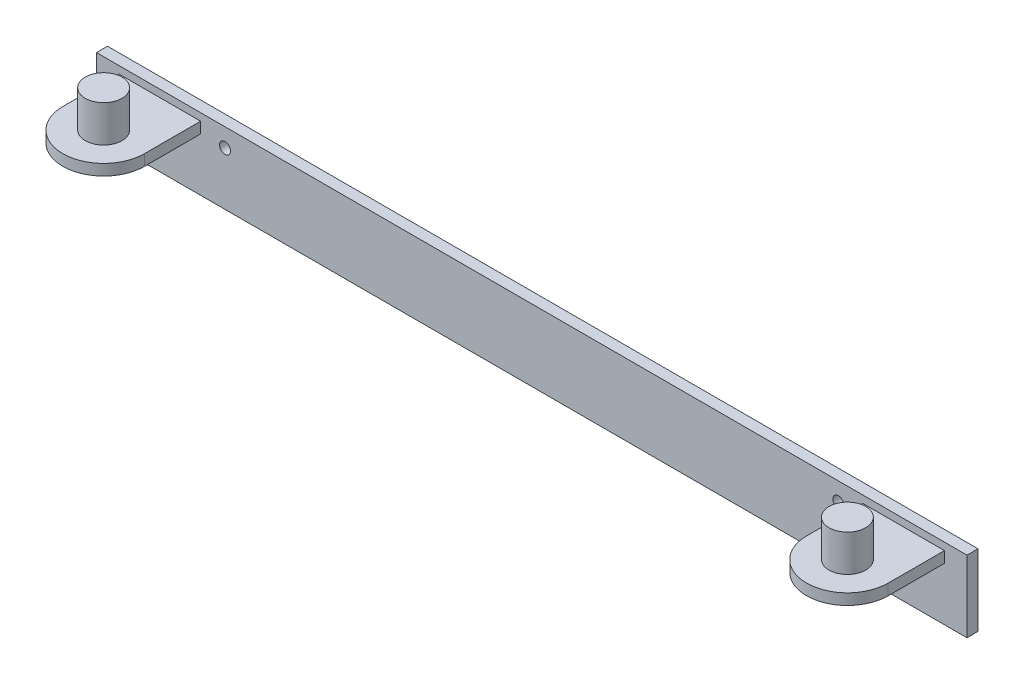
ISO-10303-21;
HEADER;
FILE_DESCRIPTION(('STEP AP214'),'2;1');
FILE_NAME('part.step','',(''),(''),'','','');
FILE_SCHEMA(('AUTOMOTIVE_DESIGN { 1 0 10303 214 1 1 1 1 }'));
ENDSEC;
DATA;
#1=APPLICATION_CONTEXT('core data for automotive mechanical design processes');
#2=APPLICATION_PROTOCOL_DEFINITION('international standard','automotive_design',2000,#1);
#3=PRODUCT_CONTEXT('',#1,'mechanical');
#4=PRODUCT('Part','Part','',(#3));
#5=PRODUCT_RELATED_PRODUCT_CATEGORY('part','',(#4));
#6=PRODUCT_DEFINITION_FORMATION('','',#4);
#7=PRODUCT_DEFINITION_CONTEXT('part definition',#1,'design');
#8=PRODUCT_DEFINITION('design','',#6,#7);
#9=PRODUCT_DEFINITION_SHAPE('','',#8);
#10=(LENGTH_UNIT() NAMED_UNIT(*) SI_UNIT(.MILLI.,.METRE.));
#11=(NAMED_UNIT(*) PLANE_ANGLE_UNIT() SI_UNIT($,.RADIAN.));
#12=(NAMED_UNIT(*) SI_UNIT($,.STERADIAN.) SOLID_ANGLE_UNIT());
#13=UNCERTAINTY_MEASURE_WITH_UNIT(LENGTH_MEASURE(1.E-05),#10,'distance_accuracy_value','');
#14=(GEOMETRIC_REPRESENTATION_CONTEXT(3) GLOBAL_UNCERTAINTY_ASSIGNED_CONTEXT((#13)) GLOBAL_UNIT_ASSIGNED_CONTEXT((#10,
#11,#12)) REPRESENTATION_CONTEXT('',''));
#15=CARTESIAN_POINT('',(0.,0.,0.));
#16=DIRECTION('',(0.,0.,1.));
#17=DIRECTION('',(1.,0.,0.));
#18=AXIS2_PLACEMENT_3D('',#15,#16,#17);
#19=CARTESIAN_POINT('',(160.782989934974,10.8857174638487,18.3099999999999));
#20=DIRECTION('',(0.,-1.,0.));
#21=DIRECTION('',(0.,0.,-1.));
#22=AXIS2_PLACEMENT_3D('',#19,#20,#21);
#23=PLANE('',#22);
#24=DIRECTION('',(0.,0.,-1.));
#25=VECTOR('',#24,1.);
#26=CARTESIAN_POINT('',(171.897989934974,10.8857174638487,2.99999999999994));
#27=LINE('',#26,#25);
#28=CARTESIAN_POINT('',(171.897989934974,10.8857174638487,18.3099999999999));
#29=VERTEX_POINT('',#28);
#30=CARTESIAN_POINT('',(171.897989934974,10.8857174638487,3.));
#31=VERTEX_POINT('',#30);
#32=EDGE_CURVE('E48',#29,#31,#27,.T.);
#33=ORIENTED_EDGE('',*,*,#32,.T.);
#34=DIRECTION('',(-1.,0.,0.));
#35=VECTOR('',#34,1.);
#36=CARTESIAN_POINT('',(171.897989934974,10.8857174638487,2.99999999999994));
#37=LINE('',#36,#35);
#38=CARTESIAN_POINT('',(149.667989934974,10.8857174638487,2.99999999999996));
#39=VERTEX_POINT('',#38);
#40=EDGE_CURVE('E146',#31,#39,#37,.T.);
#41=ORIENTED_EDGE('',*,*,#40,.T.);
#42=DIRECTION('',(0.,0.,1.));
#43=VECTOR('',#42,1.);
#44=CARTESIAN_POINT('',(149.667989934974,10.8857174638487,2.99999999999996));
#45=LINE('',#44,#43);
#46=CARTESIAN_POINT('',(149.667989934974,10.8857174638487,18.31));
#47=VERTEX_POINT('',#46);
#48=EDGE_CURVE('E238',#39,#47,#45,.T.);
#49=ORIENTED_EDGE('',*,*,#48,.T.);
#50=CARTESIAN_POINT('',(160.782989934974,10.8857174638487,18.3099999999999));
#51=DIRECTION('',(0.,1.,0.));
#52=DIRECTION('',(0.,0.,-1.));
#53=AXIS2_PLACEMENT_3D('',#50,#51,#52);
#54=CIRCLE('',#53,11.115);
#55=EDGE_CURVE('E142',#47,#29,#54,.T.);
#56=ORIENTED_EDGE('',*,*,#55,.T.);
#57=EDGE_LOOP('',(#33,#41,#49,#56));
#58=FACE_BOUND('',#57,.T.);
#59=CARTESIAN_POINT('',(160.782989934974,10.8857174638487,18.3099999999999));
#60=DIRECTION('',(0.,-1.,0.));
#61=DIRECTION('',(0.,0.,-1.));
#62=AXIS2_PLACEMENT_3D('',#59,#60,#61);
#63=CIRCLE('',#62,4.99999999999999);
#64=CARTESIAN_POINT('',(160.782989934974,10.8857174638487,13.31));
#65=VERTEX_POINT('',#64);
#66=EDGE_CURVE('E11',#65,#65,#63,.F.);
#67=ORIENTED_EDGE('',*,*,#66,.F.);
#68=EDGE_LOOP('',(#67));
#69=FACE_BOUND('',#68,.T.);
#70=ADVANCED_FACE('F31',(#58,#69),#23,.F.);
#71=CARTESIAN_POINT('',(-41.7270100650257,10.8857174638487,18.31));
#72=DIRECTION('',(0.,1.,0.));
#73=DIRECTION('',(0.,0.,1.));
#74=AXIS2_PLACEMENT_3D('',#71,#72,#73);
#75=PLANE('',#74);
#76=DIRECTION('',(-1.,0.,0.));
#77=VECTOR('',#76,1.);
#78=CARTESIAN_POINT('',(-52.8420100650257,10.8857174638487,3.));
#79=LINE('',#78,#77);
#80=CARTESIAN_POINT('',(-30.6120100650257,10.8857174638487,3.));
#81=VERTEX_POINT('',#80);
#82=CARTESIAN_POINT('',(-52.8420100650257,10.8857174638487,3.));
#83=VERTEX_POINT('',#82);
#84=EDGE_CURVE('E168',#81,#83,#79,.T.);
#85=ORIENTED_EDGE('',*,*,#84,.T.);
#86=DIRECTION('',(0.,0.,1.));
#87=VECTOR('',#86,1.);
#88=CARTESIAN_POINT('',(-52.8420100650257,10.8857174638487,3.));
#89=LINE('',#88,#87);
#90=CARTESIAN_POINT('',(-52.8420100650257,10.8857174638487,18.31));
#91=VERTEX_POINT('',#90);
#92=EDGE_CURVE('E171',#83,#91,#89,.T.);
#93=ORIENTED_EDGE('',*,*,#92,.T.);
#94=CARTESIAN_POINT('',(-41.7270100650257,10.8857174638487,18.31));
#95=DIRECTION('',(0.,1.,0.));
#96=DIRECTION('',(0.,0.,1.));
#97=AXIS2_PLACEMENT_3D('',#94,#95,#96);
#98=CIRCLE('',#97,11.115);
#99=CARTESIAN_POINT('',(-30.6120100650257,10.8857174638487,18.31));
#100=VERTEX_POINT('',#99);
#101=EDGE_CURVE('E174',#91,#100,#98,.T.);
#102=ORIENTED_EDGE('',*,*,#101,.T.);
#103=DIRECTION('',(0.,0.,-1.));
#104=VECTOR('',#103,1.);
#105=CARTESIAN_POINT('',(-30.6120100650257,10.8857174638487,3.));
#106=LINE('',#105,#104);
#107=EDGE_CURVE('E158',#100,#81,#106,.T.);
#108=ORIENTED_EDGE('',*,*,#107,.T.);
#109=EDGE_LOOP('',(#85,#93,#102,#108));
#110=FACE_BOUND('',#109,.T.);
#111=CARTESIAN_POINT('',(-41.7270100650257,10.8857174638487,18.31));
#112=DIRECTION('',(0.,1.,0.));
#113=DIRECTION('',(0.,0.,1.));
#114=AXIS2_PLACEMENT_3D('',#111,#112,#113);
#115=CIRCLE('',#114,5.);
#116=CARTESIAN_POINT('',(-41.7270100650257,10.8857174638487,23.31));
#117=VERTEX_POINT('',#116);
#118=EDGE_CURVE('E220',#117,#117,#115,.T.);
#119=ORIENTED_EDGE('',*,*,#118,.F.);
#120=EDGE_LOOP('',(#119));
#121=FACE_BOUND('',#120,.T.);
#122=ADVANCED_FACE('F259',(#110,#121),#75,.T.);
#123=CARTESIAN_POINT('',(-58.9770100650257,-6.60428253615128,3.));
#124=DIRECTION('',(0.,0.,1.));
#125=DIRECTION('',(1.,0.,0.));
#126=AXIS2_PLACEMENT_3D('',#123,#124,#125);
#127=PLANE('',#126);
#128=CARTESIAN_POINT('',(143.032989934974,7.88571746384872,3.));
#129=DIRECTION('',(0.,0.,1.));
#130=DIRECTION('',(1.,0.,0.));
#131=AXIS2_PLACEMENT_3D('',#128,#129,#130);
#132=CIRCLE('',#131,1.5);
#133=CARTESIAN_POINT('',(144.532989934974,7.88571746384872,3.));
#134=VERTEX_POINT('',#133);
#135=EDGE_CURVE('E227',#134,#134,#132,.T.);
#136=ORIENTED_EDGE('',*,*,#135,.F.);
#137=EDGE_LOOP('',(#136));
#138=FACE_BOUND('',#137,.T.);
#139=CARTESIAN_POINT('',(-23.9770100650257,7.88571746384872,3.));
#140=DIRECTION('',(0.,0.,1.));
#141=DIRECTION('',(1.,0.,0.));
#142=AXIS2_PLACEMENT_3D('',#139,#140,#141);
#143=CIRCLE('',#142,1.5);
#144=CARTESIAN_POINT('',(-22.4770100650257,7.88571746384872,3.));
#145=VERTEX_POINT('',#144);
#146=EDGE_CURVE('E216',#145,#145,#143,.T.);
#147=ORIENTED_EDGE('',*,*,#146,.F.);
#148=EDGE_LOOP('',(#147));
#149=FACE_BOUND('',#148,.T.);
#150=DIRECTION('',(-1.,0.,0.));
#151=VECTOR('',#150,1.);
#152=CARTESIAN_POINT('',(171.897989934974,7.88571746384872,2.99999999999994));
#153=LINE('',#152,#151);
#154=CARTESIAN_POINT('',(171.897989934974,7.88571746384872,2.99999999999994));
#155=VERTEX_POINT('',#154);
#156=CARTESIAN_POINT('',(149.667989934974,7.88571746384872,2.99999999999996));
#157=VERTEX_POINT('',#156);
#158=EDGE_CURVE('E125',#155,#157,#153,.T.);
#159=ORIENTED_EDGE('',*,*,#158,.T.);
#160=DIRECTION('',(0.,1.,0.));
#161=VECTOR('',#160,1.);
#162=CARTESIAN_POINT('',(149.667989934974,7.88571746384872,2.99999999999996));
#163=LINE('',#162,#161);
#164=EDGE_CURVE('E147',#157,#39,#163,.T.);
#165=ORIENTED_EDGE('',*,*,#164,.T.);
#166=ORIENTED_EDGE('',*,*,#40,.F.);
#167=DIRECTION('',(0.,1.,0.));
#168=VECTOR('',#167,1.);
#169=CARTESIAN_POINT('',(171.897989934974,7.88571746384872,2.99999999999994));
#170=LINE('',#169,#168);
#171=EDGE_CURVE('E139',#155,#31,#170,.T.);
#172=ORIENTED_EDGE('',*,*,#171,.F.);
#173=EDGE_LOOP('',(#159,#165,#166,#172));
#174=FACE_BOUND('',#173,.T.);
#175=DIRECTION('',(0.,-1.,0.));
#176=VECTOR('',#175,1.);
#177=CARTESIAN_POINT('',(-58.9770100650257,12.8857174638487,3.));
#178=LINE('',#177,#176);
#179=CARTESIAN_POINT('',(-58.9770100650257,12.8857174638487,3.));
#180=VERTEX_POINT('',#179);
#181=CARTESIAN_POINT('',(-58.9770100650257,-6.60428253615128,3.));
#182=VERTEX_POINT('',#181);
#183=EDGE_CURVE('E186',#180,#182,#178,.T.);
#184=ORIENTED_EDGE('',*,*,#183,.T.);
#185=DIRECTION('',(1.,0.,0.));
#186=VECTOR('',#185,1.);
#187=CARTESIAN_POINT('',(-58.9770100650257,-6.60428253615128,3.));
#188=LINE('',#187,#186);
#189=CARTESIAN_POINT('',(178.032989934974,-6.60428253615128,3.));
#190=VERTEX_POINT('',#189);
#191=EDGE_CURVE('E189',#182,#190,#188,.T.);
#192=ORIENTED_EDGE('',*,*,#191,.T.);
#193=DIRECTION('',(0.,1.,0.));
#194=VECTOR('',#193,1.);
#195=CARTESIAN_POINT('',(178.032989934974,12.8857174638487,3.));
#196=LINE('',#195,#194);
#197=CARTESIAN_POINT('',(178.032989934974,12.8857174638487,3.));
#198=VERTEX_POINT('',#197);
#199=EDGE_CURVE('E192',#190,#198,#196,.T.);
#200=ORIENTED_EDGE('',*,*,#199,.T.);
#201=DIRECTION('',(-1.,0.,0.));
#202=VECTOR('',#201,1.);
#203=CARTESIAN_POINT('',(-58.9770100650257,12.8857174638487,3.));
#204=LINE('',#203,#202);
#205=EDGE_CURVE('E194',#198,#180,#204,.T.);
#206=ORIENTED_EDGE('',*,*,#205,.T.);
#207=EDGE_LOOP('',(#184,#192,#200,#206));
#208=FACE_BOUND('',#207,.T.);
#209=DIRECTION('',(0.,1.,0.));
#210=VECTOR('',#209,1.);
#211=CARTESIAN_POINT('',(-30.6120100650257,7.88571746384872,3.));
#212=LINE('',#211,#210);
#213=CARTESIAN_POINT('',(-30.6120100650257,7.88571746384872,3.));
#214=VERTEX_POINT('',#213);
#215=EDGE_CURVE('E56',#214,#81,#212,.T.);
#216=ORIENTED_EDGE('',*,*,#215,.F.);
#217=DIRECTION('',(-1.,0.,0.));
#218=VECTOR('',#217,1.);
#219=CARTESIAN_POINT('',(-52.8420100650257,7.88571746384872,3.));
#220=LINE('',#219,#218);
#221=CARTESIAN_POINT('',(-52.8420100650257,7.88571746384872,3.));
#222=VERTEX_POINT('',#221);
#223=EDGE_CURVE('E155',#214,#222,#220,.T.);
#224=ORIENTED_EDGE('',*,*,#223,.T.);
#225=DIRECTION('',(0.,1.,0.));
#226=VECTOR('',#225,1.);
#227=CARTESIAN_POINT('',(-52.8420100650257,7.88571746384872,3.));
#228=LINE('',#227,#226);
#229=EDGE_CURVE('E167',#222,#83,#228,.T.);
#230=ORIENTED_EDGE('',*,*,#229,.T.);
#231=ORIENTED_EDGE('',*,*,#84,.F.);
#232=EDGE_LOOP('',(#216,#224,#230,#231));
#233=FACE_BOUND('',#232,.T.);
#234=ADVANCED_FACE('F144',(#138,#149,#174,#208,#233),#127,.T.);
#235=CARTESIAN_POINT('',(-58.9770100650257,12.8857174638487,3.));
#236=DIRECTION('',(1.,0.,0.));
#237=DIRECTION('',(0.,0.,-1.));
#238=AXIS2_PLACEMENT_3D('',#235,#236,#237);
#239=PLANE('',#238);
#240=DIRECTION('',(0.,-1.,0.));
#241=VECTOR('',#240,1.);
#242=CARTESIAN_POINT('',(-58.9770100650257,12.8857174638487,0.));
#243=LINE('',#242,#241);
#244=CARTESIAN_POINT('',(-58.9770100650257,12.8857174638487,0.));
#245=VERTEX_POINT('',#244);
#246=CARTESIAN_POINT('',(-58.9770100650257,-6.60428253615128,0.));
#247=VERTEX_POINT('',#246);
#248=EDGE_CURVE('E180',#245,#247,#243,.T.);
#249=ORIENTED_EDGE('',*,*,#248,.T.);
#250=DIRECTION('',(0.,0.,-1.));
#251=VECTOR('',#250,1.);
#252=CARTESIAN_POINT('',(-58.9770100650257,-6.60428253615128,3.));
#253=LINE('',#252,#251);
#254=EDGE_CURVE('E40',#182,#247,#253,.T.);
#255=ORIENTED_EDGE('',*,*,#254,.F.);
#256=ORIENTED_EDGE('',*,*,#183,.F.);
#257=DIRECTION('',(0.,0.,-1.));
#258=VECTOR('',#257,1.);
#259=CARTESIAN_POINT('',(-58.9770100650257,12.8857174638487,3.));
#260=LINE('',#259,#258);
#261=EDGE_CURVE('E196',#180,#245,#260,.T.);
#262=ORIENTED_EDGE('',*,*,#261,.T.);
#263=EDGE_LOOP('',(#249,#255,#256,#262));
#264=FACE_BOUND('',#263,.T.);
#265=ADVANCED_FACE('F33',(#264),#239,.F.);
#266=CARTESIAN_POINT('',(-58.9770100650257,-6.60428253615128,3.));
#267=DIRECTION('',(0.,1.,0.));
#268=DIRECTION('',(0.,0.,1.));
#269=AXIS2_PLACEMENT_3D('',#266,#267,#268);
#270=PLANE('',#269);
#271=DIRECTION('',(1.,0.,0.));
#272=VECTOR('',#271,1.);
#273=CARTESIAN_POINT('',(-58.9770100650257,-6.60428253615128,0.));
#274=LINE('',#273,#272);
#275=CARTESIAN_POINT('',(178.032989934974,-6.60428253615128,0.));
#276=VERTEX_POINT('',#275);
#277=EDGE_CURVE('E199',#247,#276,#274,.T.);
#278=ORIENTED_EDGE('',*,*,#277,.T.);
#279=DIRECTION('',(0.,0.,-1.));
#280=VECTOR('',#279,1.);
#281=CARTESIAN_POINT('',(178.032989934974,-6.60428253615128,3.));
#282=LINE('',#281,#280);
#283=EDGE_CURVE('E209',#190,#276,#282,.T.);
#284=ORIENTED_EDGE('',*,*,#283,.F.);
#285=ORIENTED_EDGE('',*,*,#191,.F.);
#286=ORIENTED_EDGE('',*,*,#254,.T.);
#287=EDGE_LOOP('',(#278,#284,#285,#286));
#288=FACE_BOUND('',#287,.T.);
#289=ADVANCED_FACE('F318',(#288),#270,.F.);
#290=CARTESIAN_POINT('',(178.032989934974,12.8857174638487,3.));
#291=DIRECTION('',(-1.,0.,0.));
#292=DIRECTION('',(0.,0.,1.));
#293=AXIS2_PLACEMENT_3D('',#290,#291,#292);
#294=PLANE('',#293);
#295=DIRECTION('',(0.,1.,0.));
#296=VECTOR('',#295,1.);
#297=CARTESIAN_POINT('',(178.032989934974,12.8857174638487,0.));
#298=LINE('',#297,#296);
#299=CARTESIAN_POINT('',(178.032989934974,12.8857174638487,0.));
#300=VERTEX_POINT('',#299);
#301=EDGE_CURVE('E201',#276,#300,#298,.T.);
#302=ORIENTED_EDGE('',*,*,#301,.T.);
#303=DIRECTION('',(0.,0.,-1.));
#304=VECTOR('',#303,1.);
#305=CARTESIAN_POINT('',(178.032989934974,12.8857174638487,3.));
#306=LINE('',#305,#304);
#307=EDGE_CURVE('E206',#198,#300,#306,.T.);
#308=ORIENTED_EDGE('',*,*,#307,.F.);
#309=ORIENTED_EDGE('',*,*,#199,.F.);
#310=ORIENTED_EDGE('',*,*,#283,.T.);
#311=EDGE_LOOP('',(#302,#308,#309,#310));
#312=FACE_BOUND('',#311,.T.);
#313=ADVANCED_FACE('F315',(#312),#294,.F.);
#314=CARTESIAN_POINT('',(-58.9770100650257,12.8857174638487,3.));
#315=DIRECTION('',(0.,-1.,0.));
#316=DIRECTION('',(0.,0.,-1.));
#317=AXIS2_PLACEMENT_3D('',#314,#315,#316);
#318=PLANE('',#317);
#319=DIRECTION('',(-1.,0.,0.));
#320=VECTOR('',#319,1.);
#321=CARTESIAN_POINT('',(-58.9770100650257,12.8857174638487,0.));
#322=LINE('',#321,#320);
#323=EDGE_CURVE('E190',#300,#245,#322,.T.);
#324=ORIENTED_EDGE('',*,*,#323,.T.);
#325=ORIENTED_EDGE('',*,*,#261,.F.);
#326=ORIENTED_EDGE('',*,*,#205,.F.);
#327=ORIENTED_EDGE('',*,*,#307,.T.);
#328=EDGE_LOOP('',(#324,#325,#326,#327));
#329=FACE_BOUND('',#328,.T.);
#330=ADVANCED_FACE('F300',(#329),#318,.F.);
#331=CARTESIAN_POINT('',(-58.9770100650257,-6.60428253615128,0.));
#332=DIRECTION('',(0.,0.,1.));
#333=DIRECTION('',(1.,0.,0.));
#334=AXIS2_PLACEMENT_3D('',#331,#332,#333);
#335=PLANE('',#334);
#336=CARTESIAN_POINT('',(143.032989934974,7.88571746384872,0.));
#337=DIRECTION('',(0.,0.,1.));
#338=DIRECTION('',(1.,0.,0.));
#339=AXIS2_PLACEMENT_3D('',#336,#337,#338);
#340=CIRCLE('',#339,1.5);
#341=CARTESIAN_POINT('',(144.532989934974,7.88571746384872,0.));
#342=VERTEX_POINT('',#341);
#343=EDGE_CURVE('E35',#342,#342,#340,.T.);
#344=ORIENTED_EDGE('',*,*,#343,.T.);
#345=EDGE_LOOP('',(#344));
#346=FACE_BOUND('',#345,.T.);
#347=CARTESIAN_POINT('',(-23.9770100650257,7.88571746384872,0.));
#348=DIRECTION('',(0.,0.,1.));
#349=DIRECTION('',(1.,0.,0.));
#350=AXIS2_PLACEMENT_3D('',#347,#348,#349);
#351=CIRCLE('',#350,1.5);
#352=CARTESIAN_POINT('',(-22.4770100650257,7.88571746384872,0.));
#353=VERTEX_POINT('',#352);
#354=EDGE_CURVE('E213',#353,#353,#351,.T.);
#355=ORIENTED_EDGE('',*,*,#354,.T.);
#356=EDGE_LOOP('',(#355));
#357=FACE_BOUND('',#356,.T.);
#358=ORIENTED_EDGE('',*,*,#248,.F.);
#359=ORIENTED_EDGE('',*,*,#323,.F.);
#360=ORIENTED_EDGE('',*,*,#301,.F.);
#361=ORIENTED_EDGE('',*,*,#277,.F.);
#362=EDGE_LOOP('',(#358,#359,#360,#361));
#363=FACE_BOUND('',#362,.T.);
#364=ADVANCED_FACE('F297',(#346,#357,#363),#335,.F.);
#365=CARTESIAN_POINT('',(-30.6120100650257,7.88571746384872,3.));
#366=DIRECTION('',(1.,0.,0.));
#367=DIRECTION('',(0.,0.,-1.));
#368=AXIS2_PLACEMENT_3D('',#365,#366,#367);
#369=PLANE('',#368);
#370=ORIENTED_EDGE('',*,*,#107,.F.);
#371=DIRECTION('',(0.,1.,0.));
#372=VECTOR('',#371,1.);
#373=CARTESIAN_POINT('',(-30.6120100650257,7.88571746384872,18.31));
#374=LINE('',#373,#372);
#375=CARTESIAN_POINT('',(-30.6120100650257,7.88571746384872,18.31));
#376=VERTEX_POINT('',#375);
#377=EDGE_CURVE('E181',#376,#100,#374,.T.);
#378=ORIENTED_EDGE('',*,*,#377,.F.);
#379=DIRECTION('',(0.,0.,-1.));
#380=VECTOR('',#379,1.);
#381=CARTESIAN_POINT('',(-30.6120100650257,7.88571746384872,3.));
#382=LINE('',#381,#380);
#383=EDGE_CURVE('E164',#376,#214,#382,.T.);
#384=ORIENTED_EDGE('',*,*,#383,.T.);
#385=ORIENTED_EDGE('',*,*,#215,.T.);
#386=EDGE_LOOP('',(#370,#378,#384,#385));
#387=FACE_BOUND('',#386,.T.);
#388=ADVANCED_FACE('F299',(#387),#369,.T.);
#389=CARTESIAN_POINT('',(-41.7270100650257,7.88571746384872,18.31));
#390=DIRECTION('',(0.,1.,0.));
#391=DIRECTION('',(0.,0.,1.));
#392=AXIS2_PLACEMENT_3D('',#389,#390,#391);
#393=CYLINDRICAL_SURFACE('',#392,11.115);
#394=ORIENTED_EDGE('',*,*,#101,.F.);
#395=DIRECTION('',(0.,1.,0.));
#396=VECTOR('',#395,1.);
#397=CARTESIAN_POINT('',(-52.8420100650257,7.88571746384872,18.31));
#398=LINE('',#397,#396);
#399=CARTESIAN_POINT('',(-52.8420100650257,7.88571746384872,18.31));
#400=VERTEX_POINT('',#399);
#401=EDGE_CURVE('E183',#400,#91,#398,.T.);
#402=ORIENTED_EDGE('',*,*,#401,.F.);
#403=CARTESIAN_POINT('',(-41.7270100650257,7.88571746384872,18.31));
#404=DIRECTION('',(0.,1.,0.));
#405=DIRECTION('',(0.,0.,1.));
#406=AXIS2_PLACEMENT_3D('',#403,#404,#405);
#407=CIRCLE('',#406,11.115);
#408=EDGE_CURVE('E161',#400,#376,#407,.T.);
#409=ORIENTED_EDGE('',*,*,#408,.T.);
#410=ORIENTED_EDGE('',*,*,#377,.T.);
#411=EDGE_LOOP('',(#394,#402,#409,#410));
#412=FACE_BOUND('',#411,.T.);
#413=ADVANCED_FACE('F357',(#412),#393,.T.);
#414=CARTESIAN_POINT('',(-52.8420100650257,7.88571746384872,3.));
#415=DIRECTION('',(-1.,0.,0.));
#416=DIRECTION('',(0.,0.,1.));
#417=AXIS2_PLACEMENT_3D('',#414,#415,#416);
#418=PLANE('',#417);
#419=ORIENTED_EDGE('',*,*,#92,.F.);
#420=ORIENTED_EDGE('',*,*,#229,.F.);
#421=DIRECTION('',(0.,0.,1.));
#422=VECTOR('',#421,1.);
#423=CARTESIAN_POINT('',(-52.8420100650257,7.88571746384872,3.));
#424=LINE('',#423,#422);
#425=EDGE_CURVE('E157',#222,#400,#424,.T.);
#426=ORIENTED_EDGE('',*,*,#425,.T.);
#427=ORIENTED_EDGE('',*,*,#401,.T.);
#428=EDGE_LOOP('',(#419,#420,#426,#427));
#429=FACE_BOUND('',#428,.T.);
#430=ADVANCED_FACE('F327',(#429),#418,.T.);
#431=CARTESIAN_POINT('',(-41.7270100650257,7.88571746384872,18.31));
#432=DIRECTION('',(0.,1.,0.));
#433=DIRECTION('',(0.,0.,1.));
#434=AXIS2_PLACEMENT_3D('',#431,#432,#433);
#435=PLANE('',#434);
#436=ORIENTED_EDGE('',*,*,#223,.F.);
#437=ORIENTED_EDGE('',*,*,#383,.F.);
#438=ORIENTED_EDGE('',*,*,#408,.F.);
#439=ORIENTED_EDGE('',*,*,#425,.F.);
#440=EDGE_LOOP('',(#436,#437,#438,#439));
#441=FACE_BOUND('',#440,.T.);
#442=ADVANCED_FACE('F255',(#441),#435,.F.);
#443=CARTESIAN_POINT('',(171.897989934974,7.88571746384872,2.99999999999994));
#444=DIRECTION('',(1.,0.,0.));
#445=DIRECTION('',(0.,0.,-1.));
#446=AXIS2_PLACEMENT_3D('',#443,#444,#445);
#447=PLANE('',#446);
#448=ORIENTED_EDGE('',*,*,#32,.F.);
#449=DIRECTION('',(0.,1.,0.));
#450=VECTOR('',#449,1.);
#451=CARTESIAN_POINT('',(171.897989934974,7.88571746384872,18.3099999999999));
#452=LINE('',#451,#450);
#453=CARTESIAN_POINT('',(171.897989934974,7.88571746384872,18.3099999999999));
#454=VERTEX_POINT('',#453);
#455=EDGE_CURVE('E141',#454,#29,#452,.T.);
#456=ORIENTED_EDGE('',*,*,#455,.F.);
#457=DIRECTION('',(0.,0.,-1.));
#458=VECTOR('',#457,1.);
#459=CARTESIAN_POINT('',(171.897989934974,7.88571746384872,2.99999999999994));
#460=LINE('',#459,#458);
#461=EDGE_CURVE('E129',#454,#155,#460,.T.);
#462=ORIENTED_EDGE('',*,*,#461,.T.);
#463=ORIENTED_EDGE('',*,*,#171,.T.);
#464=EDGE_LOOP('',(#448,#456,#462,#463));
#465=FACE_BOUND('',#464,.T.);
#466=ADVANCED_FACE('F138',(#465),#447,.T.);
#467=CARTESIAN_POINT('',(160.782989934974,7.88571746384872,18.3099999999999));
#468=DIRECTION('',(0.,1.,0.));
#469=DIRECTION('',(0.,0.,1.));
#470=AXIS2_PLACEMENT_3D('',#467,#468,#469);
#471=CYLINDRICAL_SURFACE('',#470,11.115);
#472=ORIENTED_EDGE('',*,*,#55,.F.);
#473=DIRECTION('',(0.,1.,0.));
#474=VECTOR('',#473,1.);
#475=CARTESIAN_POINT('',(149.667989934974,7.88571746384872,18.31));
#476=LINE('',#475,#474);
#477=CARTESIAN_POINT('',(149.667989934974,7.88571746384872,18.31));
#478=VERTEX_POINT('',#477);
#479=EDGE_CURVE('E150',#478,#47,#476,.T.);
#480=ORIENTED_EDGE('',*,*,#479,.F.);
#481=CARTESIAN_POINT('',(160.782989934974,7.88571746384872,18.3099999999999));
#482=DIRECTION('',(0.,1.,0.));
#483=DIRECTION('',(0.,0.,-1.));
#484=AXIS2_PLACEMENT_3D('',#481,#482,#483);
#485=CIRCLE('',#484,11.115);
#486=EDGE_CURVE('E148',#478,#454,#485,.T.);
#487=ORIENTED_EDGE('',*,*,#486,.T.);
#488=ORIENTED_EDGE('',*,*,#455,.T.);
#489=EDGE_LOOP('',(#472,#480,#487,#488));
#490=FACE_BOUND('',#489,.T.);
#491=ADVANCED_FACE('F247',(#490),#471,.T.);
#492=CARTESIAN_POINT('',(149.667989934974,7.88571746384872,2.99999999999996));
#493=DIRECTION('',(-1.,0.,0.));
#494=DIRECTION('',(0.,0.,1.));
#495=AXIS2_PLACEMENT_3D('',#492,#493,#494);
#496=PLANE('',#495);
#497=ORIENTED_EDGE('',*,*,#48,.F.);
#498=ORIENTED_EDGE('',*,*,#164,.F.);
#499=DIRECTION('',(0.,0.,1.));
#500=VECTOR('',#499,1.);
#501=CARTESIAN_POINT('',(149.667989934974,7.88571746384872,2.99999999999996));
#502=LINE('',#501,#500);
#503=EDGE_CURVE('E132',#157,#478,#502,.T.);
#504=ORIENTED_EDGE('',*,*,#503,.T.);
#505=ORIENTED_EDGE('',*,*,#479,.T.);
#506=EDGE_LOOP('',(#497,#498,#504,#505));
#507=FACE_BOUND('',#506,.T.);
#508=ADVANCED_FACE('F243',(#507),#496,.T.);
#509=CARTESIAN_POINT('',(160.782989934974,7.88571746384872,18.3099999999999));
#510=DIRECTION('',(0.,-1.,0.));
#511=DIRECTION('',(0.,0.,-1.));
#512=AXIS2_PLACEMENT_3D('',#509,#510,#511);
#513=PLANE('',#512);
#514=ORIENTED_EDGE('',*,*,#461,.F.);
#515=ORIENTED_EDGE('',*,*,#486,.F.);
#516=ORIENTED_EDGE('',*,*,#503,.F.);
#517=ORIENTED_EDGE('',*,*,#158,.F.);
#518=EDGE_LOOP('',(#514,#515,#516,#517));
#519=FACE_BOUND('',#518,.T.);
#520=ADVANCED_FACE('F127',(#519),#513,.T.);
#521=CARTESIAN_POINT('',(-41.7270100650257,20.8857174638487,18.31));
#522=DIRECTION('',(0.,-1.,0.));
#523=DIRECTION('',(0.,0.,-1.));
#524=AXIS2_PLACEMENT_3D('',#521,#522,#523);
#525=CYLINDRICAL_SURFACE('',#524,5.);
#526=CARTESIAN_POINT('',(-41.7270100650257,20.8857174638487,18.31));
#527=DIRECTION('',(0.,1.,0.));
#528=DIRECTION('',(0.,0.,1.));
#529=AXIS2_PLACEMENT_3D('',#526,#527,#528);
#530=CIRCLE('',#529,5.);
#531=CARTESIAN_POINT('',(-41.7270100650257,20.8857174638487,23.31));
#532=VERTEX_POINT('',#531);
#533=EDGE_CURVE('E230',#532,#532,#530,.T.);
#534=ORIENTED_EDGE('',*,*,#533,.F.);
#535=EDGE_LOOP('',(#534));
#536=FACE_BOUND('',#535,.T.);
#537=ORIENTED_EDGE('',*,*,#118,.T.);
#538=EDGE_LOOP('',(#537));
#539=FACE_BOUND('',#538,.T.);
#540=ADVANCED_FACE('F268',(#536,#539),#525,.T.);
#541=CARTESIAN_POINT('',(-41.7270100650257,20.8857174638487,18.31));
#542=DIRECTION('',(0.,1.,0.));
#543=DIRECTION('',(0.,0.,1.));
#544=AXIS2_PLACEMENT_3D('',#541,#542,#543);
#545=PLANE('',#544);
#546=ORIENTED_EDGE('',*,*,#533,.T.);
#547=EDGE_LOOP('',(#546));
#548=FACE_BOUND('',#547,.T.);
#549=ADVANCED_FACE('F271',(#548),#545,.T.);
#550=CARTESIAN_POINT('',(160.782989934974,20.8857174638487,18.3099999999999));
#551=DIRECTION('',(0.,-1.,0.));
#552=DIRECTION('',(0.,0.,-1.));
#553=AXIS2_PLACEMENT_3D('',#550,#551,#552);
#554=CYLINDRICAL_SURFACE('',#553,4.99999999999999);
#555=CARTESIAN_POINT('',(160.782989934974,20.8857174638487,18.3099999999999));
#556=DIRECTION('',(0.,1.,0.));
#557=DIRECTION('',(0.,0.,1.));
#558=AXIS2_PLACEMENT_3D('',#555,#556,#557);
#559=CIRCLE('',#558,4.99999999999999);
#560=CARTESIAN_POINT('',(160.782989934974,20.8857174638487,23.3099999999999));
#561=VERTEX_POINT('',#560);
#562=EDGE_CURVE('E215',#561,#561,#559,.T.);
#563=ORIENTED_EDGE('',*,*,#562,.F.);
#564=EDGE_LOOP('',(#563));
#565=FACE_BOUND('',#564,.T.);
#566=ORIENTED_EDGE('',*,*,#66,.T.);
#567=EDGE_LOOP('',(#566));
#568=FACE_BOUND('',#567,.T.);
#569=ADVANCED_FACE('F275',(#565,#568),#554,.T.);
#570=CARTESIAN_POINT('',(160.782989934974,20.8857174638487,18.3099999999999));
#571=DIRECTION('',(0.,1.,0.));
#572=DIRECTION('',(0.,0.,1.));
#573=AXIS2_PLACEMENT_3D('',#570,#571,#572);
#574=PLANE('',#573);
#575=ORIENTED_EDGE('',*,*,#562,.T.);
#576=EDGE_LOOP('',(#575));
#577=FACE_BOUND('',#576,.T.);
#578=ADVANCED_FACE('F279',(#577),#574,.T.);
#579=CARTESIAN_POINT('',(-23.9770100650257,7.88571746384872,-7.));
#580=DIRECTION('',(0.,0.,1.));
#581=DIRECTION('',(1.,0.,0.));
#582=AXIS2_PLACEMENT_3D('',#579,#580,#581);
#583=CYLINDRICAL_SURFACE('',#582,1.5);
#584=ORIENTED_EDGE('',*,*,#146,.T.);
#585=EDGE_LOOP('',(#584));
#586=FACE_BOUND('',#585,.T.);
#587=ORIENTED_EDGE('',*,*,#354,.F.);
#588=EDGE_LOOP('',(#587));
#589=FACE_BOUND('',#588,.T.);
#590=ADVANCED_FACE('F283',(#586,#589),#583,.F.);
#591=CARTESIAN_POINT('',(143.032989934974,7.88571746384872,-7.));
#592=DIRECTION('',(0.,0.,1.));
#593=DIRECTION('',(1.,0.,0.));
#594=AXIS2_PLACEMENT_3D('',#591,#592,#593);
#595=CYLINDRICAL_SURFACE('',#594,1.5);
#596=ORIENTED_EDGE('',*,*,#135,.T.);
#597=EDGE_LOOP('',(#596));
#598=FACE_BOUND('',#597,.T.);
#599=ORIENTED_EDGE('',*,*,#343,.F.);
#600=EDGE_LOOP('',(#599));
#601=FACE_BOUND('',#600,.T.);
#602=ADVANCED_FACE('F287',(#598,#601),#595,.F.);
#603=CLOSED_SHELL('',(#70,#122,#234,#265,#289,#313,#330,#364,#388,#413,#430,#442,#466,#491,#508,
#520,#540,#549,#569,#578,#590,#602));
#604=MANIFOLD_SOLID_BREP('B2',#603);
#605=ADVANCED_BREP_SHAPE_REPRESENTATION('',(#18,#604),#14);
#606=SHAPE_DEFINITION_REPRESENTATION(#9,#605);
ENDSEC;
END-ISO-10303-21;
